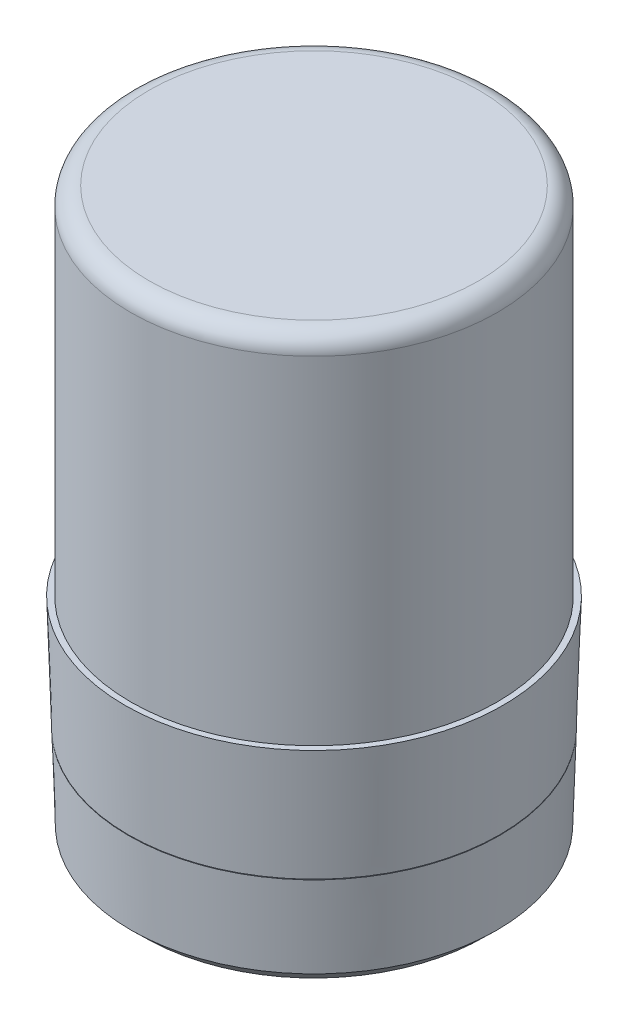
ISO-10303-21;
HEADER;
FILE_DESCRIPTION(('STEP AP214'),'2;1');
FILE_NAME('part.step','',(''),(''),'','','');
FILE_SCHEMA(('AUTOMOTIVE_DESIGN { 1 0 10303 214 1 1 1 1 }'));
ENDSEC;
DATA;
#1=APPLICATION_CONTEXT('core data for automotive mechanical design processes');
#2=APPLICATION_PROTOCOL_DEFINITION('international standard','automotive_design',2000,#1);
#3=PRODUCT_CONTEXT('',#1,'mechanical');
#4=PRODUCT('Part','Part','',(#3));
#5=PRODUCT_RELATED_PRODUCT_CATEGORY('part','',(#4));
#6=PRODUCT_DEFINITION_FORMATION('','',#4);
#7=PRODUCT_DEFINITION_CONTEXT('part definition',#1,'design');
#8=PRODUCT_DEFINITION('design','',#6,#7);
#9=PRODUCT_DEFINITION_SHAPE('','',#8);
#10=(LENGTH_UNIT() NAMED_UNIT(*) SI_UNIT(.MILLI.,.METRE.));
#11=(NAMED_UNIT(*) PLANE_ANGLE_UNIT() SI_UNIT($,.RADIAN.));
#12=(NAMED_UNIT(*) SI_UNIT($,.STERADIAN.) SOLID_ANGLE_UNIT());
#13=UNCERTAINTY_MEASURE_WITH_UNIT(LENGTH_MEASURE(1.E-05),#10,'distance_accuracy_value','');
#14=(GEOMETRIC_REPRESENTATION_CONTEXT(3) GLOBAL_UNCERTAINTY_ASSIGNED_CONTEXT((#13)) GLOBAL_UNIT_ASSIGNED_CONTEXT((#10,
#11,#12)) REPRESENTATION_CONTEXT('',''));
#15=CARTESIAN_POINT('',(0.,0.,0.));
#16=DIRECTION('',(0.,0.,1.));
#17=DIRECTION('',(1.,0.,0.));
#18=AXIS2_PLACEMENT_3D('',#15,#16,#17);
#19=CARTESIAN_POINT('',(0.,0.,0.));
#20=DIRECTION('',(0.,1.,0.));
#21=DIRECTION('',(1.,0.,0.));
#22=AXIS2_PLACEMENT_3D('',#19,#20,#21);
#23=CYLINDRICAL_SURFACE('',#22,16.5);
#24=CARTESIAN_POINT('',(0.,30.35,0.));
#25=DIRECTION('',(0.,-1.,0.));
#26=DIRECTION('',(0.,0.,-1.));
#27=AXIS2_PLACEMENT_3D('',#24,#25,#26);
#28=CIRCLE('',#27,16.5);
#29=CARTESIAN_POINT('',(0.,30.35,-16.5));
#30=VERTEX_POINT('',#29);
#31=EDGE_CURVE('E10',#30,#30,#28,.T.);
#32=ORIENTED_EDGE('',*,*,#31,.T.);
#33=EDGE_LOOP('',(#32));
#34=FACE_BOUND('',#33,.T.);
#35=CARTESIAN_POINT('',(0.,0.,0.));
#36=DIRECTION('',(0.,1.,0.));
#37=DIRECTION('',(0.,0.,1.));
#38=AXIS2_PLACEMENT_3D('',#35,#36,#37);
#39=CIRCLE('',#38,16.5);
#40=CARTESIAN_POINT('',(0.,0.,16.5));
#41=VERTEX_POINT('',#40);
#42=EDGE_CURVE('E32',#41,#41,#39,.F.);
#43=ORIENTED_EDGE('',*,*,#42,.F.);
#44=EDGE_LOOP('',(#43));
#45=FACE_BOUND('',#44,.T.);
#46=ADVANCED_FACE('F14',(#34,#45),#23,.T.);
#47=CARTESIAN_POINT('',(0.,30.35,0.));
#48=DIRECTION('',(0.,-1.,0.));
#49=DIRECTION('',(0.,0.,-1.));
#50=AXIS2_PLACEMENT_3D('',#47,#48,#49);
#51=TOROIDAL_SURFACE('',#50,14.85,1.65);
#52=CARTESIAN_POINT('',(0.,32.,0.));
#53=DIRECTION('',(0.,-1.,0.));
#54=DIRECTION('',(0.,0.,-1.));
#55=AXIS2_PLACEMENT_3D('',#52,#53,#54);
#56=CIRCLE('',#55,14.85);
#57=CARTESIAN_POINT('',(0.,32.,-14.85));
#58=VERTEX_POINT('',#57);
#59=EDGE_CURVE('E22',#58,#58,#56,.T.);
#60=ORIENTED_EDGE('',*,*,#59,.T.);
#61=EDGE_LOOP('',(#60));
#62=FACE_BOUND('',#61,.T.);
#63=ORIENTED_EDGE('',*,*,#31,.F.);
#64=EDGE_LOOP('',(#63));
#65=FACE_BOUND('',#64,.T.);
#66=ADVANCED_FACE('F82',(#62,#65),#51,.T.);
#67=CARTESIAN_POINT('',(0.,32.,0.));
#68=DIRECTION('',(0.,1.,0.));
#69=DIRECTION('',(0.,0.,1.));
#70=AXIS2_PLACEMENT_3D('',#67,#68,#69);
#71=PLANE('',#70);
#72=ORIENTED_EDGE('',*,*,#59,.F.);
#73=EDGE_LOOP('',(#72));
#74=FACE_BOUND('',#73,.T.);
#75=ADVANCED_FACE('F87',(#74),#71,.T.);
#76=CARTESIAN_POINT('',(17.021125,0.,0.));
#77=DIRECTION('',(0.,1.,0.));
#78=DIRECTION('',(0.,0.,1.));
#79=AXIS2_PLACEMENT_3D('',#76,#77,#78);
#80=PLANE('',#79);
#81=ORIENTED_EDGE('',*,*,#42,.T.);
#82=EDGE_LOOP('',(#81));
#83=FACE_BOUND('',#82,.T.);
#84=CARTESIAN_POINT('',(0.,0.,0.));
#85=DIRECTION('',(0.,-1.,0.));
#86=DIRECTION('',(0.,0.,-1.));
#87=AXIS2_PLACEMENT_3D('',#84,#85,#86);
#88=CIRCLE('',#87,17.021125);
#89=CARTESIAN_POINT('',(0.,0.,-17.021125));
#90=VERTEX_POINT('',#89);
#91=EDGE_CURVE('E46',#90,#90,#88,.T.);
#92=ORIENTED_EDGE('',*,*,#91,.F.);
#93=EDGE_LOOP('',(#92));
#94=FACE_BOUND('',#93,.T.);
#95=ADVANCED_FACE('F78',(#83,#94),#80,.T.);
#96=CARTESIAN_POINT('',(0.,-17.80449566,0.));
#97=DIRECTION('',(0.,1.,0.));
#98=DIRECTION('',(0.,0.,1.));
#99=AXIS2_PLACEMENT_3D('',#96,#97,#98);
#100=CONICAL_SURFACE('',#99,16.464734510625,0.0312398334302684);
#101=CARTESIAN_POINT('',(0.,-10.26,0.));
#102=DIRECTION('',(0.,1.,0.));
#103=DIRECTION('',(0.,0.,1.));
#104=AXIS2_PLACEMENT_3D('',#101,#102,#103);
#105=CIRCLE('',#104,16.7005);
#106=CARTESIAN_POINT('',(0.,-10.26,16.7005));
#107=VERTEX_POINT('',#106);
#108=EDGE_CURVE('E35',#107,#107,#105,.F.);
#109=ORIENTED_EDGE('',*,*,#108,.F.);
#110=EDGE_LOOP('',(#109));
#111=FACE_BOUND('',#110,.T.);
#112=ORIENTED_EDGE('',*,*,#91,.T.);
#113=EDGE_LOOP('',(#112));
#114=FACE_BOUND('',#113,.T.);
#115=ADVANCED_FACE('F98',(#111,#114),#100,.T.);
#116=CARTESIAN_POINT('',(0.,-10.21,0.));
#117=DIRECTION('',(0.,1.,0.));
#118=DIRECTION('',(0.,0.,1.));
#119=AXIS2_PLACEMENT_3D('',#116,#117,#118);
#120=PLANE('',#119);
#121=CARTESIAN_POINT('',(0.,-10.21,0.));
#122=DIRECTION('',(0.,1.,0.));
#123=DIRECTION('',(0.,0.,1.));
#124=AXIS2_PLACEMENT_3D('',#121,#122,#123);
#125=CIRCLE('',#124,15.50499566);
#126=CARTESIAN_POINT('',(0.,-10.21,15.50499566));
#127=VERTEX_POINT('',#126);
#128=EDGE_CURVE('E49',#127,#127,#125,.T.);
#129=ORIENTED_EDGE('',*,*,#128,.T.);
#130=EDGE_LOOP('',(#129));
#131=FACE_BOUND('',#130,.T.);
#132=CARTESIAN_POINT('',(0.,-10.21,0.));
#133=DIRECTION('',(0.,-1.,0.));
#134=DIRECTION('',(1.,0.,0.));
#135=AXIS2_PLACEMENT_3D('',#132,#133,#134);
#136=CIRCLE('',#135,16.7005);
#137=CARTESIAN_POINT('',(16.7005,-10.21,0.));
#138=VERTEX_POINT('',#137);
#139=EDGE_CURVE('E38',#138,#138,#136,.T.);
#140=ORIENTED_EDGE('',*,*,#139,.T.);
#141=EDGE_LOOP('',(#140));
#142=FACE_BOUND('',#141,.T.);
#143=ADVANCED_FACE('F111',(#131,#142),#120,.F.);
#144=CARTESIAN_POINT('',(0.,-10.31,0.));
#145=DIRECTION('',(0.,-1.,0.));
#146=DIRECTION('',(0.,0.,-1.));
#147=AXIS2_PLACEMENT_3D('',#144,#145,#146);
#148=PLANE('',#147);
#149=CARTESIAN_POINT('',(0.,-10.31,0.));
#150=DIRECTION('',(0.,-1.,0.));
#151=DIRECTION('',(0.,0.,-1.));
#152=AXIS2_PLACEMENT_3D('',#149,#150,#151);
#153=CIRCLE('',#152,16.6989375);
#154=CARTESIAN_POINT('',(0.,-10.31,-16.6989375));
#155=VERTEX_POINT('',#154);
#156=EDGE_CURVE('E17',#155,#155,#153,.F.);
#157=ORIENTED_EDGE('',*,*,#156,.T.);
#158=EDGE_LOOP('',(#157));
#159=FACE_BOUND('',#158,.T.);
#160=CARTESIAN_POINT('',(0.,-10.31,0.));
#161=DIRECTION('',(0.,-1.,0.));
#162=DIRECTION('',(0.,0.,-1.));
#163=AXIS2_PLACEMENT_3D('',#160,#161,#162);
#164=CIRCLE('',#163,15.50499566);
#165=CARTESIAN_POINT('',(0.,-10.31,-15.50499566));
#166=VERTEX_POINT('',#165);
#167=EDGE_CURVE('E57',#166,#166,#164,.T.);
#168=ORIENTED_EDGE('',*,*,#167,.T.);
#169=EDGE_LOOP('',(#168));
#170=FACE_BOUND('',#169,.T.);
#171=ADVANCED_FACE('F116',(#159,#170),#148,.F.);
#172=CARTESIAN_POINT('',(0.,-10.31,0.));
#173=DIRECTION('',(0.,1.,0.));
#174=DIRECTION('',(1.,0.,0.));
#175=AXIS2_PLACEMENT_3D('',#172,#173,#174);
#176=CYLINDRICAL_SURFACE('',#175,16.7005);
#177=ORIENTED_EDGE('',*,*,#108,.T.);
#178=EDGE_LOOP('',(#177));
#179=FACE_BOUND('',#178,.T.);
#180=ORIENTED_EDGE('',*,*,#139,.F.);
#181=EDGE_LOOP('',(#180));
#182=FACE_BOUND('',#181,.T.);
#183=ADVANCED_FACE('F113',(#179,#182),#176,.F.);
#184=CARTESIAN_POINT('',(0.,-10.32,0.));
#185=DIRECTION('',(0.,1.,0.));
#186=DIRECTION('',(1.,0.,0.));
#187=AXIS2_PLACEMENT_3D('',#184,#185,#186);
#188=CYLINDRICAL_SURFACE('',#187,15.50499566);
#189=ORIENTED_EDGE('',*,*,#128,.F.);
#190=EDGE_LOOP('',(#189));
#191=FACE_BOUND('',#190,.T.);
#192=ORIENTED_EDGE('',*,*,#167,.F.);
#193=EDGE_LOOP('',(#192));
#194=FACE_BOUND('',#193,.T.);
#195=ADVANCED_FACE('F103',(#191,#194),#188,.T.);
#196=CARTESIAN_POINT('',(0.,-19.,0.));
#197=DIRECTION('',(0.,-1.,0.));
#198=DIRECTION('',(0.,0.,-1.));
#199=AXIS2_PLACEMENT_3D('',#196,#197,#198);
#200=PLANE('',#199);
#201=CARTESIAN_POINT('',(0.,-19.,0.));
#202=DIRECTION('',(0.,-1.,0.));
#203=DIRECTION('',(0.,0.,-1.));
#204=AXIS2_PLACEMENT_3D('',#201,#202,#203);
#205=CIRCLE('',#204,15.23187066);
#206=CARTESIAN_POINT('',(0.,-19.,-15.23187066));
#207=VERTEX_POINT('',#206);
#208=EDGE_CURVE('E70',#207,#207,#205,.T.);
#209=ORIENTED_EDGE('',*,*,#208,.T.);
#210=EDGE_LOOP('',(#209));
#211=FACE_BOUND('',#210,.T.);
#212=ADVANCED_FACE('F99',(#211),#200,.T.);
#213=CARTESIAN_POINT('',(0.,-19.,0.));
#214=DIRECTION('',(0.,1.,0.));
#215=DIRECTION('',(0.,0.,1.));
#216=AXIS2_PLACEMENT_3D('',#213,#214,#215);
#217=CONICAL_SURFACE('',#216,15.23187066,0.800781565178042);
#218=CARTESIAN_POINT('',(0.,-17.80449566,0.));
#219=DIRECTION('',(0.,-1.,0.));
#220=DIRECTION('',(0.,0.,-1.));
#221=AXIS2_PLACEMENT_3D('',#218,#219,#220);
#222=CIRCLE('',#221,16.464734510625);
#223=CARTESIAN_POINT('',(0.,-17.80449566,-16.464734510625));
#224=VERTEX_POINT('',#223);
#225=EDGE_CURVE('E66',#224,#224,#222,.T.);
#226=ORIENTED_EDGE('',*,*,#225,.T.);
#227=EDGE_LOOP('',(#226));
#228=FACE_BOUND('',#227,.T.);
#229=ORIENTED_EDGE('',*,*,#208,.F.);
#230=EDGE_LOOP('',(#229));
#231=FACE_BOUND('',#230,.T.);
#232=ADVANCED_FACE('F102',(#228,#231),#217,.T.);
#233=ORIENTED_EDGE('',*,*,#156,.F.);
#234=EDGE_LOOP('',(#233));
#235=FACE_BOUND('',#234,.T.);
#236=ORIENTED_EDGE('',*,*,#225,.F.);
#237=EDGE_LOOP('',(#236));
#238=FACE_BOUND('',#237,.T.);
#239=ADVANCED_FACE('F107',(#235,#238),#100,.T.);
#240=CLOSED_SHELL('',(#46,#66,#75,#95,#115,#143,#171,#183,#195,#212,#232,#239));
#241=MANIFOLD_SOLID_BREP('B1',#240);
#242=ADVANCED_BREP_SHAPE_REPRESENTATION('',(#18,#241),#14);
#243=SHAPE_DEFINITION_REPRESENTATION(#9,#242);
ENDSEC;
END-ISO-10303-21;
